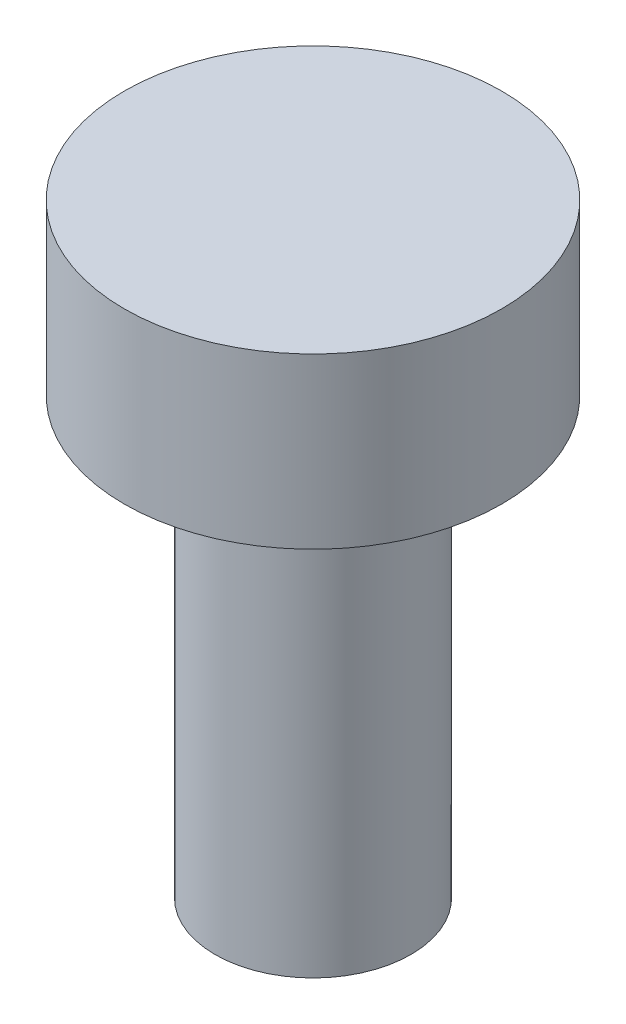
ISO-10303-21;
HEADER;
FILE_DESCRIPTION(('STEP AP214'),'2;1');
FILE_NAME('part.step','',(''),(''),'','','');
FILE_SCHEMA(('AUTOMOTIVE_DESIGN { 1 0 10303 214 1 1 1 1 }'));
ENDSEC;
DATA;
#1=APPLICATION_CONTEXT('core data for automotive mechanical design processes');
#2=APPLICATION_PROTOCOL_DEFINITION('international standard','automotive_design',2000,#1);
#3=PRODUCT_CONTEXT('',#1,'mechanical');
#4=PRODUCT('Part','Part','',(#3));
#5=PRODUCT_RELATED_PRODUCT_CATEGORY('part','',(#4));
#6=PRODUCT_DEFINITION_FORMATION('','',#4);
#7=PRODUCT_DEFINITION_CONTEXT('part definition',#1,'design');
#8=PRODUCT_DEFINITION('design','',#6,#7);
#9=PRODUCT_DEFINITION_SHAPE('','',#8);
#10=(LENGTH_UNIT() NAMED_UNIT(*) SI_UNIT(.MILLI.,.METRE.));
#11=(NAMED_UNIT(*) PLANE_ANGLE_UNIT() SI_UNIT($,.RADIAN.));
#12=(NAMED_UNIT(*) SI_UNIT($,.STERADIAN.) SOLID_ANGLE_UNIT());
#13=UNCERTAINTY_MEASURE_WITH_UNIT(LENGTH_MEASURE(1.E-05),#10,'distance_accuracy_value','');
#14=(GEOMETRIC_REPRESENTATION_CONTEXT(3) GLOBAL_UNCERTAINTY_ASSIGNED_CONTEXT((#13)) GLOBAL_UNIT_ASSIGNED_CONTEXT((#10,
#11,#12)) REPRESENTATION_CONTEXT('',''));
#15=CARTESIAN_POINT('',(0.,0.,0.));
#16=DIRECTION('',(0.,0.,1.));
#17=DIRECTION('',(1.,0.,0.));
#18=AXIS2_PLACEMENT_3D('',#15,#16,#17);
#19=CARTESIAN_POINT('',(0.,6.,0.));
#20=DIRECTION('',(0.,-1.,0.));
#21=DIRECTION('',(0.,0.,-1.));
#22=AXIS2_PLACEMENT_3D('',#19,#20,#21);
#23=CYLINDRICAL_SURFACE('',#22,1.35);
#24=CARTESIAN_POINT('',(0.,6.,0.));
#25=DIRECTION('',(0.,1.,0.));
#26=DIRECTION('',(0.,0.,1.));
#27=AXIS2_PLACEMENT_3D('',#24,#25,#26);
#28=CIRCLE('',#27,1.35);
#29=CARTESIAN_POINT('',(0.,6.,1.35));
#30=VERTEX_POINT('',#29);
#31=EDGE_CURVE('E10',#30,#30,#28,.T.);
#32=ORIENTED_EDGE('',*,*,#31,.F.);
#33=EDGE_LOOP('',(#32));
#34=FACE_BOUND('',#33,.T.);
#35=CARTESIAN_POINT('',(0.,0.,0.));
#36=DIRECTION('',(0.,1.,0.));
#37=DIRECTION('',(0.,0.,1.));
#38=AXIS2_PLACEMENT_3D('',#35,#36,#37);
#39=CIRCLE('',#38,1.35);
#40=CARTESIAN_POINT('',(0.,0.,1.35));
#41=VERTEX_POINT('',#40);
#42=EDGE_CURVE('E33',#41,#41,#39,.T.);
#43=ORIENTED_EDGE('',*,*,#42,.T.);
#44=EDGE_LOOP('',(#43));
#45=FACE_BOUND('',#44,.T.);
#46=ADVANCED_FACE('F30',(#34,#45),#23,.T.);
#47=CARTESIAN_POINT('',(0.,0.,0.));
#48=DIRECTION('',(0.,1.,0.));
#49=DIRECTION('',(0.,0.,1.));
#50=AXIS2_PLACEMENT_3D('',#47,#48,#49);
#51=PLANE('',#50);
#52=ORIENTED_EDGE('',*,*,#42,.F.);
#53=EDGE_LOOP('',(#52));
#54=FACE_BOUND('',#53,.T.);
#55=ADVANCED_FACE('F53',(#54),#51,.F.);
#56=CARTESIAN_POINT('',(0.,8.33,0.));
#57=DIRECTION('',(0.,-1.,0.));
#58=DIRECTION('',(0.,0.,-1.));
#59=AXIS2_PLACEMENT_3D('',#56,#57,#58);
#60=CYLINDRICAL_SURFACE('',#59,2.6);
#61=CARTESIAN_POINT('',(0.,8.33,0.));
#62=DIRECTION('',(0.,1.,0.));
#63=DIRECTION('',(0.,0.,1.));
#64=AXIS2_PLACEMENT_3D('',#61,#62,#63);
#65=CIRCLE('',#64,2.6);
#66=CARTESIAN_POINT('',(0.,8.33,2.6));
#67=VERTEX_POINT('',#66);
#68=EDGE_CURVE('E40',#67,#67,#65,.T.);
#69=ORIENTED_EDGE('',*,*,#68,.F.);
#70=EDGE_LOOP('',(#69));
#71=FACE_BOUND('',#70,.T.);
#72=CARTESIAN_POINT('',(0.,6.,0.));
#73=DIRECTION('',(0.,1.,0.));
#74=DIRECTION('',(0.,0.,1.));
#75=AXIS2_PLACEMENT_3D('',#72,#73,#74);
#76=CIRCLE('',#75,2.6);
#77=CARTESIAN_POINT('',(0.,6.,2.6));
#78=VERTEX_POINT('',#77);
#79=EDGE_CURVE('E42',#78,#78,#76,.T.);
#80=ORIENTED_EDGE('',*,*,#79,.T.);
#81=EDGE_LOOP('',(#80));
#82=FACE_BOUND('',#81,.T.);
#83=ADVANCED_FACE('F50',(#71,#82),#60,.T.);
#84=CARTESIAN_POINT('',(0.,8.33,0.));
#85=DIRECTION('',(0.,1.,0.));
#86=DIRECTION('',(0.,0.,1.));
#87=AXIS2_PLACEMENT_3D('',#84,#85,#86);
#88=PLANE('',#87);
#89=ORIENTED_EDGE('',*,*,#68,.T.);
#90=EDGE_LOOP('',(#89));
#91=FACE_BOUND('',#90,.T.);
#92=ADVANCED_FACE('F48',(#91),#88,.T.);
#93=CARTESIAN_POINT('',(0.,6.,0.));
#94=DIRECTION('',(0.,1.,0.));
#95=DIRECTION('',(0.,0.,1.));
#96=AXIS2_PLACEMENT_3D('',#93,#94,#95);
#97=PLANE('',#96);
#98=ORIENTED_EDGE('',*,*,#31,.T.);
#99=EDGE_LOOP('',(#98));
#100=FACE_BOUND('',#99,.T.);
#101=ORIENTED_EDGE('',*,*,#79,.F.);
#102=EDGE_LOOP('',(#101));
#103=FACE_BOUND('',#102,.T.);
#104=ADVANCED_FACE('F57',(#100,#103),#97,.F.);
#105=CLOSED_SHELL('',(#46,#55,#83,#92,#104));
#106=MANIFOLD_SOLID_BREP('B2',#105);
#107=ADVANCED_BREP_SHAPE_REPRESENTATION('',(#18,#106),#14);
#108=SHAPE_DEFINITION_REPRESENTATION(#9,#107);
ENDSEC;
END-ISO-10303-21;
